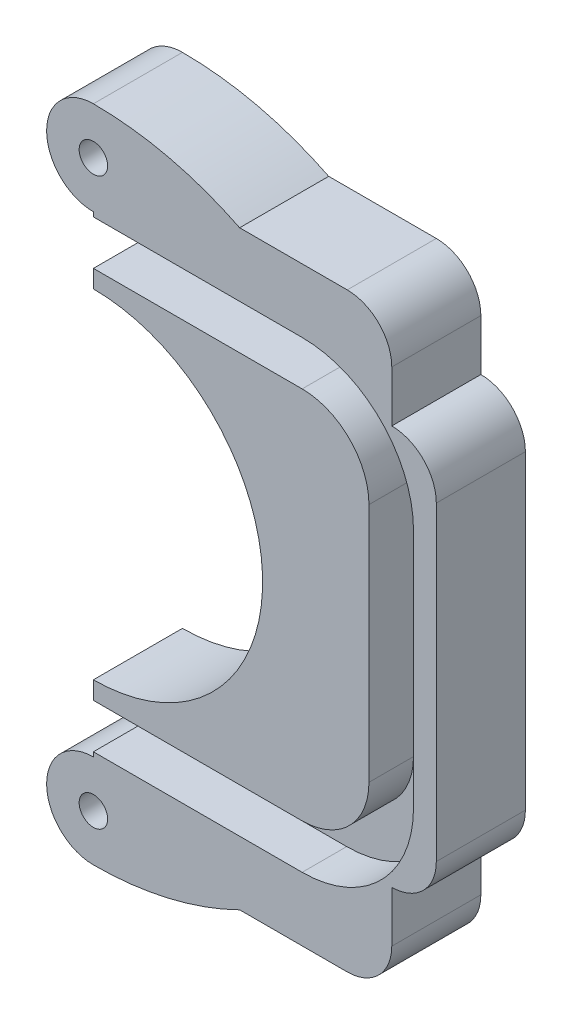
ISO-10303-21;
HEADER;
FILE_DESCRIPTION(('STEP AP214'),'2;1');
FILE_NAME('part.step','',(''),(''),'','','');
FILE_SCHEMA(('AUTOMOTIVE_DESIGN { 1 0 10303 214 1 1 1 1 }'));
ENDSEC;
DATA;
#1=APPLICATION_CONTEXT('core data for automotive mechanical design processes');
#2=APPLICATION_PROTOCOL_DEFINITION('international standard','automotive_design',2000,#1);
#3=PRODUCT_CONTEXT('',#1,'mechanical');
#4=PRODUCT('Part','Part','',(#3));
#5=PRODUCT_RELATED_PRODUCT_CATEGORY('part','',(#4));
#6=PRODUCT_DEFINITION_FORMATION('','',#4);
#7=PRODUCT_DEFINITION_CONTEXT('part definition',#1,'design');
#8=PRODUCT_DEFINITION('design','',#6,#7);
#9=PRODUCT_DEFINITION_SHAPE('','',#8);
#10=(LENGTH_UNIT() NAMED_UNIT(*) SI_UNIT(.MILLI.,.METRE.));
#11=(NAMED_UNIT(*) PLANE_ANGLE_UNIT() SI_UNIT($,.RADIAN.));
#12=(NAMED_UNIT(*) SI_UNIT($,.STERADIAN.) SOLID_ANGLE_UNIT());
#13=UNCERTAINTY_MEASURE_WITH_UNIT(LENGTH_MEASURE(1.E-05),#10,'distance_accuracy_value','');
#14=(GEOMETRIC_REPRESENTATION_CONTEXT(3) GLOBAL_UNCERTAINTY_ASSIGNED_CONTEXT((#13)) GLOBAL_UNIT_ASSIGNED_CONTEXT((#10,
#11,#12)) REPRESENTATION_CONTEXT('',''));
#15=CARTESIAN_POINT('',(0.,0.,0.));
#16=DIRECTION('',(0.,0.,1.));
#17=DIRECTION('',(1.,0.,0.));
#18=AXIS2_PLACEMENT_3D('',#15,#16,#17);
#19=CARTESIAN_POINT('',(0.,0.,10.));
#20=DIRECTION('',(0.,0.,1.));
#21=DIRECTION('',(1.,0.,0.));
#22=AXIS2_PLACEMENT_3D('',#19,#20,#21);
#23=PLANE('',#22);
#24=DIRECTION('',(1.,0.,0.));
#25=VECTOR('',#24,1.);
#26=CARTESIAN_POINT('',(0.,-151.667340501082,10.));
#27=LINE('',#26,#25);
#28=CARTESIAN_POINT('',(-48.1265911761758,-151.667340501082,10.));
#29=VERTEX_POINT('',#28);
#30=CARTESIAN_POINT('',(-24.6887468039078,-151.667340501082,10.));
#31=VERTEX_POINT('',#30);
#32=EDGE_CURVE('E51',#29,#31,#27,.T.);
#33=ORIENTED_EDGE('',*,*,#32,.F.);
#34=DIRECTION('',(0.,1.,0.));
#35=VECTOR('',#34,1.);
#36=CARTESIAN_POINT('',(-48.1265911761761,0.,10.));
#37=LINE('',#36,#35);
#38=CARTESIAN_POINT('',(-48.1265911761758,-153.667340501079,10.));
#39=VERTEX_POINT('',#38);
#40=EDGE_CURVE('E194',#39,#29,#37,.T.);
#41=ORIENTED_EDGE('',*,*,#40,.F.);
#42=CARTESIAN_POINT('',(-48.1265911761758,-172.667340501079,10.));
#43=DIRECTION('',(0.,0.,1.));
#44=DIRECTION('',(1.,0.,0.));
#45=AXIS2_PLACEMENT_3D('',#42,#43,#44);
#46=CIRCLE('',#45,19.);
#47=CARTESIAN_POINT('',(-48.1265911761758,-191.667340501079,10.));
#48=VERTEX_POINT('',#47);
#49=EDGE_CURVE('E249',#48,#39,#46,.T.);
#50=ORIENTED_EDGE('',*,*,#49,.F.);
#51=DIRECTION('',(0.,1.,0.));
#52=VECTOR('',#51,1.);
#53=CARTESIAN_POINT('',(-48.1265911761754,0.,10.));
#54=LINE('',#53,#52);
#55=CARTESIAN_POINT('',(-48.1265911761758,-193.667340501082,10.));
#56=VERTEX_POINT('',#55);
#57=EDGE_CURVE('E122',#56,#48,#54,.T.);
#58=ORIENTED_EDGE('',*,*,#57,.F.);
#59=DIRECTION('',(1.,0.,0.));
#60=VECTOR('',#59,1.);
#61=CARTESIAN_POINT('',(0.,-193.667340501082,10.));
#62=LINE('',#61,#60);
#63=CARTESIAN_POINT('',(-24.6887468039078,-193.667340501082,10.));
#64=VERTEX_POINT('',#63);
#65=EDGE_CURVE('E463',#56,#64,#62,.T.);
#66=ORIENTED_EDGE('',*,*,#65,.T.);
#67=CARTESIAN_POINT('',(-24.6887468039078,-186.167340501082,10.));
#68=DIRECTION('',(0.,0.,1.));
#69=DIRECTION('',(1.,0.,0.));
#70=AXIS2_PLACEMENT_3D('',#67,#68,#69);
#71=CIRCLE('',#70,7.5);
#72=CARTESIAN_POINT('',(-17.1887468039078,-186.167340501082,10.));
#73=VERTEX_POINT('',#72);
#74=EDGE_CURVE('E460',#64,#73,#71,.T.);
#75=ORIENTED_EDGE('',*,*,#74,.T.);
#76=DIRECTION('',(0.,1.,0.));
#77=VECTOR('',#76,1.);
#78=CARTESIAN_POINT('',(-17.1887468039078,0.,10.));
#79=LINE('',#78,#77);
#80=CARTESIAN_POINT('',(-17.1887468039078,-159.167340501082,10.));
#81=VERTEX_POINT('',#80);
#82=EDGE_CURVE('E457',#73,#81,#79,.T.);
#83=ORIENTED_EDGE('',*,*,#82,.T.);
#84=CARTESIAN_POINT('',(-24.6887468039078,-159.167340501082,10.));
#85=DIRECTION('',(0.,0.,1.));
#86=DIRECTION('',(1.,0.,0.));
#87=AXIS2_PLACEMENT_3D('',#84,#85,#86);
#88=CIRCLE('',#87,7.5);
#89=EDGE_CURVE('E455',#31,#81,#88,.F.);
#90=ORIENTED_EDGE('',*,*,#89,.F.);
#91=EDGE_LOOP('',(#33,#41,#50,#58,#66,#75,#83,#90));
#92=FACE_BOUND('',#91,.T.);
#93=ADVANCED_FACE('F36',(#92),#23,.T.);
#94=CARTESIAN_POINT('',(-48.1265911761758,-172.667340501079,10.));
#95=DIRECTION('',(0.,0.,-1.));
#96=DIRECTION('',(-1.,0.,0.));
#97=AXIS2_PLACEMENT_3D('',#94,#95,#96);
#98=CYLINDRICAL_SURFACE('',#97,19.);
#99=CARTESIAN_POINT('',(-48.1265911761758,-172.667340501079,0.));
#100=DIRECTION('',(0.,0.,1.));
#101=DIRECTION('',(1.,0.,0.));
#102=AXIS2_PLACEMENT_3D('',#99,#100,#101);
#103=CIRCLE('',#102,19.);
#104=CARTESIAN_POINT('',(-48.1265911761758,-191.667340501079,0.));
#105=VERTEX_POINT('',#104);
#106=CARTESIAN_POINT('',(-48.1265911761758,-153.667340501079,0.));
#107=VERTEX_POINT('',#106);
#108=EDGE_CURVE('E204',#105,#107,#103,.T.);
#109=ORIENTED_EDGE('',*,*,#108,.F.);
#110=DIRECTION('',(0.,0.,-1.));
#111=VECTOR('',#110,1.);
#112=CARTESIAN_POINT('',(-48.1265911761758,-191.667340501079,10.));
#113=LINE('',#112,#111);
#114=EDGE_CURVE('E11',#48,#105,#113,.T.);
#115=ORIENTED_EDGE('',*,*,#114,.F.);
#116=ORIENTED_EDGE('',*,*,#49,.T.);
#117=DIRECTION('',(0.,0.,-1.));
#118=VECTOR('',#117,1.);
#119=CARTESIAN_POINT('',(-48.1265911761758,-153.667340501079,10.));
#120=LINE('',#119,#118);
#121=EDGE_CURVE('E60',#39,#107,#120,.T.);
#122=ORIENTED_EDGE('',*,*,#121,.T.);
#123=EDGE_LOOP('',(#109,#115,#116,#122));
#124=FACE_BOUND('',#123,.T.);
#125=ADVANCED_FACE('F38',(#124),#98,.F.);
#126=CARTESIAN_POINT('',(-48.1265911761754,0.,10.));
#127=DIRECTION('',(-1.,0.,0.));
#128=DIRECTION('',(0.,-1.,0.));
#129=AXIS2_PLACEMENT_3D('',#126,#127,#128);
#130=PLANE('',#129);
#131=DIRECTION('',(0.,0.,1.));
#132=VECTOR('',#131,1.);
#133=CARTESIAN_POINT('',(-48.1265911761758,-198.667340501082,5.));
#134=LINE('',#133,#132);
#135=CARTESIAN_POINT('',(-48.1265911761758,-198.667340501082,5.));
#136=VERTEX_POINT('',#135);
#137=CARTESIAN_POINT('',(-48.1265911761758,-198.667340501082,10.));
#138=VERTEX_POINT('',#137);
#139=EDGE_CURVE('E486',#136,#138,#134,.T.);
#140=ORIENTED_EDGE('',*,*,#139,.F.);
#141=DIRECTION('',(0.,-1.,0.));
#142=VECTOR('',#141,1.);
#143=CARTESIAN_POINT('',(-48.1265911761754,0.,5.));
#144=LINE('',#143,#142);
#145=CARTESIAN_POINT('',(-48.1265911761758,-193.667340501082,5.));
#146=VERTEX_POINT('',#145);
#147=EDGE_CURVE('E437',#146,#136,#144,.T.);
#148=ORIENTED_EDGE('',*,*,#147,.F.);
#149=DIRECTION('',(0.,0.,1.));
#150=VECTOR('',#149,1.);
#151=CARTESIAN_POINT('',(-48.1265911761758,-193.667340501082,5.));
#152=LINE('',#151,#150);
#153=EDGE_CURVE('E488',#146,#56,#152,.T.);
#154=ORIENTED_EDGE('',*,*,#153,.T.);
#155=ORIENTED_EDGE('',*,*,#57,.T.);
#156=ORIENTED_EDGE('',*,*,#114,.T.);
#157=DIRECTION('',(0.,1.,0.));
#158=VECTOR('',#157,1.);
#159=CARTESIAN_POINT('',(-48.1265911761754,0.,0.));
#160=LINE('',#159,#158);
#161=CARTESIAN_POINT('',(-48.1265911761758,-199.167340501079,0.));
#162=VERTEX_POINT('',#161);
#163=EDGE_CURVE('E206',#162,#105,#160,.T.);
#164=ORIENTED_EDGE('',*,*,#163,.F.);
#165=DIRECTION('',(0.,0.,-1.));
#166=VECTOR('',#165,1.);
#167=CARTESIAN_POINT('',(-48.1265911761758,-199.167340501079,10.));
#168=LINE('',#167,#166);
#169=CARTESIAN_POINT('',(-48.1265911761758,-199.167340501079,10.));
#170=VERTEX_POINT('',#169);
#171=EDGE_CURVE('E44',#170,#162,#168,.T.);
#172=ORIENTED_EDGE('',*,*,#171,.F.);
#173=EDGE_CURVE('E303',#170,#138,#54,.T.);
#174=ORIENTED_EDGE('',*,*,#173,.T.);
#175=EDGE_LOOP('',(#140,#148,#154,#155,#156,#164,#172,#174));
#176=FACE_BOUND('',#175,.T.);
#177=ADVANCED_FACE('F287',(#176),#130,.T.);
#178=CARTESIAN_POINT('',(-48.1265911761758,-204.417342708545,10.));
#179=DIRECTION('',(0.,0.,-1.));
#180=DIRECTION('',(-1.,0.,0.));
#181=AXIS2_PLACEMENT_3D('',#178,#179,#180);
#182=CYLINDRICAL_SURFACE('',#181,5.25000220746617);
#183=CARTESIAN_POINT('',(-48.1265911761758,-204.417342708545,0.));
#184=DIRECTION('',(0.,0.,1.));
#185=DIRECTION('',(1.,0.,0.));
#186=AXIS2_PLACEMENT_3D('',#183,#184,#185);
#187=CIRCLE('',#186,5.25000220746617);
#188=CARTESIAN_POINT('',(-48.1265911761758,-209.667344916011,0.));
#189=VERTEX_POINT('',#188);
#190=EDGE_CURVE('E210',#189,#162,#187,.F.);
#191=ORIENTED_EDGE('',*,*,#190,.F.);
#192=DIRECTION('',(0.,0.,-1.));
#193=VECTOR('',#192,1.);
#194=CARTESIAN_POINT('',(-48.1265911761758,-209.667344916011,10.));
#195=LINE('',#194,#193);
#196=CARTESIAN_POINT('',(-48.1265911761758,-209.667344916011,10.));
#197=VERTEX_POINT('',#196);
#198=EDGE_CURVE('E276',#197,#189,#195,.T.);
#199=ORIENTED_EDGE('',*,*,#198,.F.);
#200=CARTESIAN_POINT('',(-48.1265911761758,-204.417342708545,10.));
#201=DIRECTION('',(0.,0.,1.));
#202=DIRECTION('',(1.,0.,0.));
#203=AXIS2_PLACEMENT_3D('',#200,#201,#202);
#204=CIRCLE('',#203,5.25000220746617);
#205=EDGE_CURVE('E283',#197,#170,#204,.F.);
#206=ORIENTED_EDGE('',*,*,#205,.T.);
#207=ORIENTED_EDGE('',*,*,#171,.T.);
#208=EDGE_LOOP('',(#191,#199,#206,#207));
#209=FACE_BOUND('',#208,.T.);
#210=ADVANCED_FACE('F281',(#209),#182,.T.);
#211=CARTESIAN_POINT('',(-48.1265911761758,-172.667340501079,10.));
#212=DIRECTION('',(0.,0.,-1.));
#213=DIRECTION('',(-1.,0.,0.));
#214=AXIS2_PLACEMENT_3D('',#211,#212,#213);
#215=CYLINDRICAL_SURFACE('',#214,37.0000044149324);
#216=CARTESIAN_POINT('',(-48.1265911761758,-172.667340501079,0.));
#217=DIRECTION('',(0.,0.,1.));
#218=DIRECTION('',(1.,0.,0.));
#219=AXIS2_PLACEMENT_3D('',#216,#217,#218);
#220=CIRCLE('',#219,37.0000044149324);
#221=CARTESIAN_POINT('',(-31.7060790227308,-205.824045815744,0.));
#222=VERTEX_POINT('',#221);
#223=EDGE_CURVE('E213',#189,#222,#220,.T.);
#224=ORIENTED_EDGE('',*,*,#223,.T.);
#225=DIRECTION('',(0.,0.,-1.));
#226=VECTOR('',#225,1.);
#227=CARTESIAN_POINT('',(-31.7060790227308,-205.824045815744,10.));
#228=LINE('',#227,#226);
#229=CARTESIAN_POINT('',(-31.7060790227308,-205.824045815744,10.));
#230=VERTEX_POINT('',#229);
#231=EDGE_CURVE('E274',#230,#222,#228,.T.);
#232=ORIENTED_EDGE('',*,*,#231,.F.);
#233=CARTESIAN_POINT('',(-48.1265911761758,-172.667340501079,10.));
#234=DIRECTION('',(0.,0.,1.));
#235=DIRECTION('',(1.,0.,0.));
#236=AXIS2_PLACEMENT_3D('',#233,#234,#235);
#237=CIRCLE('',#236,37.0000044149324);
#238=EDGE_CURVE('E298',#197,#230,#237,.T.);
#239=ORIENTED_EDGE('',*,*,#238,.F.);
#240=ORIENTED_EDGE('',*,*,#198,.T.);
#241=EDGE_LOOP('',(#224,#232,#239,#240));
#242=FACE_BOUND('',#241,.T.);
#243=ADVANCED_FACE('F295',(#242),#215,.T.);
#244=CARTESIAN_POINT('',(0.,-205.824045815744,10.));
#245=DIRECTION('',(0.,-1.,0.));
#246=DIRECTION('',(0.,0.,-1.));
#247=AXIS2_PLACEMENT_3D('',#244,#245,#246);
#248=PLANE('',#247);
#249=DIRECTION('',(-1.,0.,0.));
#250=VECTOR('',#249,1.);
#251=CARTESIAN_POINT('',(0.,-205.824045815744,0.));
#252=LINE('',#251,#250);
#253=CARTESIAN_POINT('',(-19.6282092260401,-205.824045815744,0.));
#254=VERTEX_POINT('',#253);
#255=EDGE_CURVE('E216',#254,#222,#252,.T.);
#256=ORIENTED_EDGE('',*,*,#255,.F.);
#257=DIRECTION('',(0.,0.,-1.));
#258=VECTOR('',#257,1.);
#259=CARTESIAN_POINT('',(-19.6282092260401,-205.824045815744,10.));
#260=LINE('',#259,#258);
#261=CARTESIAN_POINT('',(-19.6282092260401,-205.824045815744,10.));
#262=VERTEX_POINT('',#261);
#263=EDGE_CURVE('E272',#262,#254,#260,.T.);
#264=ORIENTED_EDGE('',*,*,#263,.F.);
#265=DIRECTION('',(-1.,0.,0.));
#266=VECTOR('',#265,1.);
#267=CARTESIAN_POINT('',(0.,-205.824045815744,10.));
#268=LINE('',#267,#266);
#269=EDGE_CURVE('E300',#262,#230,#268,.T.);
#270=ORIENTED_EDGE('',*,*,#269,.T.);
#271=ORIENTED_EDGE('',*,*,#231,.T.);
#272=EDGE_LOOP('',(#256,#264,#270,#271));
#273=FACE_BOUND('',#272,.T.);
#274=ADVANCED_FACE('F591',(#273),#248,.T.);
#275=CARTESIAN_POINT('',(-19.6282092260401,-200.824045815744,10.));
#276=DIRECTION('',(0.,0.,-1.));
#277=DIRECTION('',(-1.,0.,0.));
#278=AXIS2_PLACEMENT_3D('',#275,#276,#277);
#279=CYLINDRICAL_SURFACE('',#278,5.);
#280=CARTESIAN_POINT('',(-19.6282092260401,-200.824045815744,0.));
#281=DIRECTION('',(0.,0.,1.));
#282=DIRECTION('',(1.,0.,0.));
#283=AXIS2_PLACEMENT_3D('',#280,#281,#282);
#284=CIRCLE('',#283,5.);
#285=CARTESIAN_POINT('',(-14.6282092260401,-200.824045815744,0.));
#286=VERTEX_POINT('',#285);
#287=EDGE_CURVE('E219',#286,#254,#284,.F.);
#288=ORIENTED_EDGE('',*,*,#287,.F.);
#289=DIRECTION('',(0.,0.,-1.));
#290=VECTOR('',#289,1.);
#291=CARTESIAN_POINT('',(-14.6282092260401,-200.824045815744,10.));
#292=LINE('',#291,#290);
#293=CARTESIAN_POINT('',(-14.6282092260401,-200.824045815744,10.));
#294=VERTEX_POINT('',#293);
#295=EDGE_CURVE('E270',#294,#286,#292,.T.);
#296=ORIENTED_EDGE('',*,*,#295,.F.);
#297=CARTESIAN_POINT('',(-19.6282092260401,-200.824045815744,10.));
#298=DIRECTION('',(0.,0.,1.));
#299=DIRECTION('',(1.,0.,0.));
#300=AXIS2_PLACEMENT_3D('',#297,#298,#299);
#301=CIRCLE('',#300,5.);
#302=EDGE_CURVE('E309',#294,#262,#301,.F.);
#303=ORIENTED_EDGE('',*,*,#302,.T.);
#304=ORIENTED_EDGE('',*,*,#263,.T.);
#305=EDGE_LOOP('',(#288,#296,#303,#304));
#306=FACE_BOUND('',#305,.T.);
#307=ADVANCED_FACE('F587',(#306),#279,.T.);
#308=CARTESIAN_POINT('',(-14.6282092260401,0.,10.));
#309=DIRECTION('',(1.,0.,0.));
#310=DIRECTION('',(0.,0.,-1.));
#311=AXIS2_PLACEMENT_3D('',#308,#309,#310);
#312=PLANE('',#311);
#313=DIRECTION('',(0.,-1.,0.));
#314=VECTOR('',#313,1.);
#315=CARTESIAN_POINT('',(-14.6282092260401,0.,0.));
#316=LINE('',#315,#314);
#317=CARTESIAN_POINT('',(-14.6282092260401,-195.092578039896,0.));
#318=VERTEX_POINT('',#317);
#319=EDGE_CURVE('E222',#318,#286,#316,.T.);
#320=ORIENTED_EDGE('',*,*,#319,.F.);
#321=DIRECTION('',(0.,0.,-1.));
#322=VECTOR('',#321,1.);
#323=CARTESIAN_POINT('',(-14.6282092260401,-195.092578039896,10.));
#324=LINE('',#323,#322);
#325=CARTESIAN_POINT('',(-14.6282092260401,-195.092578039896,10.));
#326=VERTEX_POINT('',#325);
#327=EDGE_CURVE('E268',#326,#318,#324,.T.);
#328=ORIENTED_EDGE('',*,*,#327,.F.);
#329=DIRECTION('',(0.,-1.,0.));
#330=VECTOR('',#329,1.);
#331=CARTESIAN_POINT('',(-14.6282092260401,0.,10.));
#332=LINE('',#331,#330);
#333=EDGE_CURVE('E312',#326,#294,#332,.T.);
#334=ORIENTED_EDGE('',*,*,#333,.T.);
#335=ORIENTED_EDGE('',*,*,#295,.T.);
#336=EDGE_LOOP('',(#320,#328,#334,#335));
#337=FACE_BOUND('',#336,.T.);
#338=ADVANCED_FACE('F583',(#337),#312,.T.);
#339=CARTESIAN_POINT('',(-14.6282092260401,-190.092578039896,10.));
#340=DIRECTION('',(0.,0.,-1.));
#341=DIRECTION('',(-1.,0.,0.));
#342=AXIS2_PLACEMENT_3D('',#339,#340,#341);
#343=CYLINDRICAL_SURFACE('',#342,5.);
#344=CARTESIAN_POINT('',(-14.6282092260401,-190.092578039896,0.));
#345=DIRECTION('',(0.,0.,1.));
#346=DIRECTION('',(1.,0.,0.));
#347=AXIS2_PLACEMENT_3D('',#344,#345,#346);
#348=CIRCLE('',#347,5.);
#349=CARTESIAN_POINT('',(-9.62820922604008,-190.092578039896,0.));
#350=VERTEX_POINT('',#349);
#351=EDGE_CURVE('E225',#318,#350,#348,.T.);
#352=ORIENTED_EDGE('',*,*,#351,.T.);
#353=DIRECTION('',(0.,0.,-1.));
#354=VECTOR('',#353,1.);
#355=CARTESIAN_POINT('',(-9.62820922604008,-190.092578039896,10.));
#356=LINE('',#355,#354);
#357=CARTESIAN_POINT('',(-9.62820922604008,-190.092578039896,10.));
#358=VERTEX_POINT('',#357);
#359=EDGE_CURVE('E265',#358,#350,#356,.T.);
#360=ORIENTED_EDGE('',*,*,#359,.F.);
#361=CARTESIAN_POINT('',(-14.6282092260401,-190.092578039896,10.));
#362=DIRECTION('',(0.,0.,1.));
#363=DIRECTION('',(1.,0.,0.));
#364=AXIS2_PLACEMENT_3D('',#361,#362,#363);
#365=CIRCLE('',#364,5.);
#366=EDGE_CURVE('E315',#326,#358,#365,.T.);
#367=ORIENTED_EDGE('',*,*,#366,.F.);
#368=ORIENTED_EDGE('',*,*,#327,.T.);
#369=EDGE_LOOP('',(#352,#360,#367,#368));
#370=FACE_BOUND('',#369,.T.);
#371=ADVANCED_FACE('F579',(#370),#343,.T.);
#372=CARTESIAN_POINT('',(-9.62820922604008,0.,10.));
#373=DIRECTION('',(-1.,0.,0.));
#374=DIRECTION('',(0.,0.,1.));
#375=AXIS2_PLACEMENT_3D('',#372,#373,#374);
#376=PLANE('',#375);
#377=DIRECTION('',(0.,1.,0.));
#378=VECTOR('',#377,1.);
#379=CARTESIAN_POINT('',(-9.62820922604008,0.,0.));
#380=LINE('',#379,#378);
#381=CARTESIAN_POINT('',(-9.62820922604008,-155.239636863425,0.));
#382=VERTEX_POINT('',#381);
#383=EDGE_CURVE('E227',#350,#382,#380,.T.);
#384=ORIENTED_EDGE('',*,*,#383,.T.);
#385=DIRECTION('',(0.,0.,-1.));
#386=VECTOR('',#385,1.);
#387=CARTESIAN_POINT('',(-9.62820922604008,-155.239636863425,10.));
#388=LINE('',#387,#386);
#389=CARTESIAN_POINT('',(-9.62820922604008,-155.239636863425,10.));
#390=VERTEX_POINT('',#389);
#391=EDGE_CURVE('E262',#390,#382,#388,.T.);
#392=ORIENTED_EDGE('',*,*,#391,.F.);
#393=DIRECTION('',(0.,1.,0.));
#394=VECTOR('',#393,1.);
#395=CARTESIAN_POINT('',(-9.62820922604008,0.,10.));
#396=LINE('',#395,#394);
#397=EDGE_CURVE('E317',#358,#390,#396,.T.);
#398=ORIENTED_EDGE('',*,*,#397,.F.);
#399=ORIENTED_EDGE('',*,*,#359,.T.);
#400=EDGE_LOOP('',(#384,#392,#398,#399));
#401=FACE_BOUND('',#400,.T.);
#402=ADVANCED_FACE('F575',(#401),#376,.F.);
#403=CARTESIAN_POINT('',(-14.6282090740635,-155.240869651084,10.));
#404=DIRECTION('',(0.,0.,-1.));
#405=DIRECTION('',(-1.,0.,0.));
#406=AXIS2_PLACEMENT_3D('',#403,#404,#405);
#407=CYLINDRICAL_SURFACE('',#406,5.00000000000002);
#408=CARTESIAN_POINT('',(-14.6282090740635,-155.240869651084,0.));
#409=DIRECTION('',(0.,0.,1.));
#410=DIRECTION('',(1.,0.,0.));
#411=AXIS2_PLACEMENT_3D('',#408,#409,#410);
#412=CIRCLE('',#411,5.00000000000002);
#413=CARTESIAN_POINT('',(-14.6265911761759,-150.240869912843,0.));
#414=VERTEX_POINT('',#413);
#415=EDGE_CURVE('E229',#382,#414,#412,.T.);
#416=ORIENTED_EDGE('',*,*,#415,.T.);
#417=DIRECTION('',(0.,0.,-1.));
#418=VECTOR('',#417,1.);
#419=CARTESIAN_POINT('',(-14.6265911761759,-150.240869912843,10.));
#420=LINE('',#419,#418);
#421=CARTESIAN_POINT('',(-14.6265911761759,-150.240869912843,10.));
#422=VERTEX_POINT('',#421);
#423=EDGE_CURVE('E259',#422,#414,#420,.T.);
#424=ORIENTED_EDGE('',*,*,#423,.F.);
#425=CARTESIAN_POINT('',(-14.6282090740635,-155.240869651084,10.));
#426=DIRECTION('',(0.,0.,1.));
#427=DIRECTION('',(1.,0.,0.));
#428=AXIS2_PLACEMENT_3D('',#425,#426,#427);
#429=CIRCLE('',#428,5.00000000000002);
#430=EDGE_CURVE('E319',#390,#422,#429,.T.);
#431=ORIENTED_EDGE('',*,*,#430,.F.);
#432=ORIENTED_EDGE('',*,*,#391,.T.);
#433=EDGE_LOOP('',(#416,#424,#431,#432));
#434=FACE_BOUND('',#433,.T.);
#435=ADVANCED_FACE('F571',(#434),#407,.T.);
#436=CARTESIAN_POINT('',(-14.6265911761759,0.,10.));
#437=DIRECTION('',(-1.,0.,0.));
#438=DIRECTION('',(0.,0.,1.));
#439=AXIS2_PLACEMENT_3D('',#436,#437,#438);
#440=PLANE('',#439);
#441=DIRECTION('',(0.,1.,0.));
#442=VECTOR('',#441,1.);
#443=CARTESIAN_POINT('',(-14.6265911761759,0.,0.));
#444=LINE('',#443,#442);
#445=CARTESIAN_POINT('',(-14.6265911761759,-144.510294404022,0.));
#446=VERTEX_POINT('',#445);
#447=EDGE_CURVE('E231',#414,#446,#444,.T.);
#448=ORIENTED_EDGE('',*,*,#447,.T.);
#449=DIRECTION('',(0.,0.,-1.));
#450=VECTOR('',#449,1.);
#451=CARTESIAN_POINT('',(-14.6265911761759,-144.510294404022,10.));
#452=LINE('',#451,#450);
#453=CARTESIAN_POINT('',(-14.6265911761759,-144.510294404022,10.));
#454=VERTEX_POINT('',#453);
#455=EDGE_CURVE('E256',#454,#446,#452,.T.);
#456=ORIENTED_EDGE('',*,*,#455,.F.);
#457=DIRECTION('',(0.,1.,0.));
#458=VECTOR('',#457,1.);
#459=CARTESIAN_POINT('',(-14.6265911761759,0.,10.));
#460=LINE('',#459,#458);
#461=EDGE_CURVE('E321',#422,#454,#460,.T.);
#462=ORIENTED_EDGE('',*,*,#461,.F.);
#463=ORIENTED_EDGE('',*,*,#423,.T.);
#464=EDGE_LOOP('',(#448,#456,#462,#463));
#465=FACE_BOUND('',#464,.T.);
#466=ADVANCED_FACE('F568',(#465),#440,.F.);
#467=CARTESIAN_POINT('',(-19.6265911761759,-144.510294404022,10.));
#468=DIRECTION('',(0.,0.,-1.));
#469=DIRECTION('',(-1.,0.,0.));
#470=AXIS2_PLACEMENT_3D('',#467,#468,#469);
#471=CYLINDRICAL_SURFACE('',#470,5.);
#472=CARTESIAN_POINT('',(-19.6265911761759,-144.510294404022,0.));
#473=DIRECTION('',(0.,0.,1.));
#474=DIRECTION('',(1.,0.,0.));
#475=AXIS2_PLACEMENT_3D('',#472,#473,#474);
#476=CIRCLE('',#475,5.);
#477=CARTESIAN_POINT('',(-19.626591176176,-139.510294404022,0.));
#478=VERTEX_POINT('',#477);
#479=EDGE_CURVE('E233',#446,#478,#476,.T.);
#480=ORIENTED_EDGE('',*,*,#479,.T.);
#481=DIRECTION('',(0.,0.,-1.));
#482=VECTOR('',#481,1.);
#483=CARTESIAN_POINT('',(-19.626591176176,-139.510294404022,10.));
#484=LINE('',#483,#482);
#485=CARTESIAN_POINT('',(-19.626591176176,-139.510294404022,10.));
#486=VERTEX_POINT('',#485);
#487=EDGE_CURVE('E253',#486,#478,#484,.T.);
#488=ORIENTED_EDGE('',*,*,#487,.F.);
#489=CARTESIAN_POINT('',(-19.6265911761759,-144.510294404022,10.));
#490=DIRECTION('',(0.,0.,1.));
#491=DIRECTION('',(1.,0.,0.));
#492=AXIS2_PLACEMENT_3D('',#489,#490,#491);
#493=CIRCLE('',#492,5.);
#494=EDGE_CURVE('E323',#454,#486,#493,.T.);
#495=ORIENTED_EDGE('',*,*,#494,.F.);
#496=ORIENTED_EDGE('',*,*,#455,.T.);
#497=EDGE_LOOP('',(#480,#488,#495,#496));
#498=FACE_BOUND('',#497,.T.);
#499=ADVANCED_FACE('F329',(#498),#471,.T.);
#500=CARTESIAN_POINT('',(0.,-139.510294404022,10.));
#501=DIRECTION('',(0.,-1.,0.));
#502=DIRECTION('',(0.,0.,-1.));
#503=AXIS2_PLACEMENT_3D('',#500,#501,#502);
#504=PLANE('',#503);
#505=DIRECTION('',(-1.,0.,0.));
#506=VECTOR('',#505,1.);
#507=CARTESIAN_POINT('',(0.,-139.510294404022,0.));
#508=LINE('',#507,#506);
#509=CARTESIAN_POINT('',(-31.7067771054365,-139.510294404022,0.));
#510=VERTEX_POINT('',#509);
#511=EDGE_CURVE('E235',#478,#510,#508,.T.);
#512=ORIENTED_EDGE('',*,*,#511,.T.);
#513=DIRECTION('',(0.,0.,-1.));
#514=VECTOR('',#513,1.);
#515=CARTESIAN_POINT('',(-31.7067771054365,-139.510294404022,10.));
#516=LINE('',#515,#514);
#517=CARTESIAN_POINT('',(-31.7067771054365,-139.510294404022,10.));
#518=VERTEX_POINT('',#517);
#519=EDGE_CURVE('E187',#518,#510,#516,.T.);
#520=ORIENTED_EDGE('',*,*,#519,.F.);
#521=DIRECTION('',(-1.,0.,0.));
#522=VECTOR('',#521,1.);
#523=CARTESIAN_POINT('',(0.,-139.510294404022,10.));
#524=LINE('',#523,#522);
#525=EDGE_CURVE('E174',#486,#518,#524,.T.);
#526=ORIENTED_EDGE('',*,*,#525,.F.);
#527=ORIENTED_EDGE('',*,*,#487,.T.);
#528=EDGE_LOOP('',(#512,#520,#526,#527));
#529=FACE_BOUND('',#528,.T.);
#530=ADVANCED_FACE('F333',(#529),#504,.F.);
#531=CARTESIAN_POINT('',(-48.1265911761758,-172.667340501079,10.));
#532=DIRECTION('',(0.,0.,-1.));
#533=DIRECTION('',(-1.,0.,0.));
#534=AXIS2_PLACEMENT_3D('',#531,#532,#533);
#535=CYLINDRICAL_SURFACE('',#534,37.);
#536=CARTESIAN_POINT('',(-48.1265911761758,-172.667340501079,0.));
#537=DIRECTION('',(0.,0.,1.));
#538=DIRECTION('',(1.,0.,0.));
#539=AXIS2_PLACEMENT_3D('',#536,#537,#538);
#540=CIRCLE('',#539,37.);
#541=CARTESIAN_POINT('',(-48.1265911761758,-135.667340501079,0.));
#542=VERTEX_POINT('',#541);
#543=EDGE_CURVE('E183',#510,#542,#540,.T.);
#544=ORIENTED_EDGE('',*,*,#543,.T.);
#545=DIRECTION('',(0.,0.,-1.));
#546=VECTOR('',#545,1.);
#547=CARTESIAN_POINT('',(-48.1265911761758,-135.667340501079,10.));
#548=LINE('',#547,#546);
#549=CARTESIAN_POINT('',(-48.1265911761758,-135.667340501079,10.));
#550=VERTEX_POINT('',#549);
#551=EDGE_CURVE('E180',#550,#542,#548,.T.);
#552=ORIENTED_EDGE('',*,*,#551,.F.);
#553=CARTESIAN_POINT('',(-48.1265911761758,-172.667340501079,10.));
#554=DIRECTION('',(0.,0.,1.));
#555=DIRECTION('',(1.,0.,0.));
#556=AXIS2_PLACEMENT_3D('',#553,#554,#555);
#557=CIRCLE('',#556,37.);
#558=EDGE_CURVE('E166',#518,#550,#557,.T.);
#559=ORIENTED_EDGE('',*,*,#558,.F.);
#560=ORIENTED_EDGE('',*,*,#519,.T.);
#561=EDGE_LOOP('',(#544,#552,#559,#560));
#562=FACE_BOUND('',#561,.T.);
#563=ADVANCED_FACE('F181',(#562),#535,.T.);
#564=CARTESIAN_POINT('',(-48.1265911761758,-140.917340501079,10.));
#565=DIRECTION('',(0.,0.,-1.));
#566=DIRECTION('',(-1.,0.,0.));
#567=AXIS2_PLACEMENT_3D('',#564,#565,#566);
#568=CYLINDRICAL_SURFACE('',#567,5.25);
#569=CARTESIAN_POINT('',(-48.1265911761758,-140.917340501079,0.));
#570=DIRECTION('',(0.,0.,1.));
#571=DIRECTION('',(1.,0.,0.));
#572=AXIS2_PLACEMENT_3D('',#569,#570,#571);
#573=CIRCLE('',#572,5.25);
#574=CARTESIAN_POINT('',(-48.1265911761758,-146.167340501079,0.));
#575=VERTEX_POINT('',#574);
#576=EDGE_CURVE('E238',#575,#542,#573,.F.);
#577=ORIENTED_EDGE('',*,*,#576,.F.);
#578=DIRECTION('',(0.,0.,-1.));
#579=VECTOR('',#578,1.);
#580=CARTESIAN_POINT('',(-48.1265911761758,-146.167340501079,10.));
#581=LINE('',#580,#579);
#582=CARTESIAN_POINT('',(-48.1265911761758,-146.167340501079,10.));
#583=VERTEX_POINT('',#582);
#584=EDGE_CURVE('E188',#583,#575,#581,.T.);
#585=ORIENTED_EDGE('',*,*,#584,.F.);
#586=CARTESIAN_POINT('',(-48.1265911761758,-140.917340501079,10.));
#587=DIRECTION('',(0.,0.,1.));
#588=DIRECTION('',(1.,0.,0.));
#589=AXIS2_PLACEMENT_3D('',#586,#587,#588);
#590=CIRCLE('',#589,5.25);
#591=EDGE_CURVE('E172',#583,#550,#590,.F.);
#592=ORIENTED_EDGE('',*,*,#591,.T.);
#593=ORIENTED_EDGE('',*,*,#551,.T.);
#594=EDGE_LOOP('',(#577,#585,#592,#593));
#595=FACE_BOUND('',#594,.T.);
#596=ADVANCED_FACE('F191',(#595),#568,.T.);
#597=CARTESIAN_POINT('',(-48.1265911761758,-140.917340501079,10.));
#598=DIRECTION('',(0.,0.,-1.));
#599=DIRECTION('',(-1.,0.,0.));
#600=AXIS2_PLACEMENT_3D('',#597,#598,#599);
#601=CYLINDRICAL_SURFACE('',#600,1.6);
#602=CARTESIAN_POINT('',(-48.1265911761758,-140.917340501079,10.));
#603=DIRECTION('',(0.,0.,1.));
#604=DIRECTION('',(1.,0.,0.));
#605=AXIS2_PLACEMENT_3D('',#602,#603,#604);
#606=CIRCLE('',#605,1.6);
#607=CARTESIAN_POINT('',(-46.5265911761758,-140.917340501079,10.));
#608=VERTEX_POINT('',#607);
#609=EDGE_CURVE('E198',#608,#608,#606,.T.);
#610=ORIENTED_EDGE('',*,*,#609,.T.);
#611=EDGE_LOOP('',(#610));
#612=FACE_BOUND('',#611,.T.);
#613=CARTESIAN_POINT('',(-48.1265911761758,-140.917340501079,0.));
#614=DIRECTION('',(0.,0.,1.));
#615=DIRECTION('',(1.,0.,0.));
#616=AXIS2_PLACEMENT_3D('',#613,#614,#615);
#617=CIRCLE('',#616,1.6);
#618=CARTESIAN_POINT('',(-46.5265911761758,-140.917340501079,0.));
#619=VERTEX_POINT('',#618);
#620=EDGE_CURVE('E243',#619,#619,#617,.T.);
#621=ORIENTED_EDGE('',*,*,#620,.F.);
#622=EDGE_LOOP('',(#621));
#623=FACE_BOUND('',#622,.T.);
#624=ADVANCED_FACE('F553',(#612,#623),#601,.F.);
#625=CARTESIAN_POINT('',(-48.1265911761761,0.,10.));
#626=DIRECTION('',(-1.,0.,0.));
#627=DIRECTION('',(0.,-1.,0.));
#628=AXIS2_PLACEMENT_3D('',#625,#626,#627);
#629=PLANE('',#628);
#630=DIRECTION('',(0.,0.,1.));
#631=VECTOR('',#630,1.);
#632=CARTESIAN_POINT('',(-48.1265911761758,-151.667340501082,5.));
#633=LINE('',#632,#631);
#634=CARTESIAN_POINT('',(-48.1265911761758,-151.667340501082,5.));
#635=VERTEX_POINT('',#634);
#636=EDGE_CURVE('E207',#635,#29,#633,.T.);
#637=ORIENTED_EDGE('',*,*,#636,.F.);
#638=DIRECTION('',(0.,-1.,0.));
#639=VECTOR('',#638,1.);
#640=CARTESIAN_POINT('',(-48.1265911761761,0.,5.));
#641=LINE('',#640,#639);
#642=CARTESIAN_POINT('',(-48.1265911761758,-146.667340501082,5.));
#643=VERTEX_POINT('',#642);
#644=EDGE_CURVE('E416',#643,#635,#641,.T.);
#645=ORIENTED_EDGE('',*,*,#644,.F.);
#646=DIRECTION('',(0.,0.,1.));
#647=VECTOR('',#646,1.);
#648=CARTESIAN_POINT('',(-48.1265911761758,-146.667340501082,5.));
#649=LINE('',#648,#647);
#650=CARTESIAN_POINT('',(-48.1265911761758,-146.667340501082,10.));
#651=VERTEX_POINT('',#650);
#652=EDGE_CURVE('E340',#643,#651,#649,.T.);
#653=ORIENTED_EDGE('',*,*,#652,.T.);
#654=EDGE_CURVE('E192',#651,#583,#37,.T.);
#655=ORIENTED_EDGE('',*,*,#654,.T.);
#656=ORIENTED_EDGE('',*,*,#584,.T.);
#657=DIRECTION('',(0.,1.,0.));
#658=VECTOR('',#657,1.);
#659=CARTESIAN_POINT('',(-48.1265911761761,0.,0.));
#660=LINE('',#659,#658);
#661=EDGE_CURVE('E240',#107,#575,#660,.T.);
#662=ORIENTED_EDGE('',*,*,#661,.F.);
#663=ORIENTED_EDGE('',*,*,#121,.F.);
#664=ORIENTED_EDGE('',*,*,#40,.T.);
#665=EDGE_LOOP('',(#637,#645,#653,#655,#656,#662,#663,#664));
#666=FACE_BOUND('',#665,.T.);
#667=ADVANCED_FACE('F335',(#666),#629,.T.);
#668=CARTESIAN_POINT('',(-48.1265911761758,-204.417342708545,10.));
#669=DIRECTION('',(0.,0.,-1.));
#670=DIRECTION('',(-1.,0.,0.));
#671=AXIS2_PLACEMENT_3D('',#668,#669,#670);
#672=CYLINDRICAL_SURFACE('',#671,1.6);
#673=CARTESIAN_POINT('',(-48.1265911761758,-204.417342708545,10.));
#674=DIRECTION('',(0.,0.,1.));
#675=DIRECTION('',(1.,0.,0.));
#676=AXIS2_PLACEMENT_3D('',#673,#674,#675);
#677=CIRCLE('',#676,1.6);
#678=CARTESIAN_POINT('',(-46.5265911761758,-204.417342708545,10.));
#679=VERTEX_POINT('',#678);
#680=EDGE_CURVE('E201',#679,#679,#677,.T.);
#681=ORIENTED_EDGE('',*,*,#680,.T.);
#682=EDGE_LOOP('',(#681));
#683=FACE_BOUND('',#682,.T.);
#684=CARTESIAN_POINT('',(-48.1265911761758,-204.417342708545,0.));
#685=DIRECTION('',(0.,0.,1.));
#686=DIRECTION('',(1.,0.,0.));
#687=AXIS2_PLACEMENT_3D('',#684,#685,#686);
#688=CIRCLE('',#687,1.6);
#689=CARTESIAN_POINT('',(-46.5265911761758,-204.417342708545,0.));
#690=VERTEX_POINT('',#689);
#691=EDGE_CURVE('E246',#690,#690,#688,.T.);
#692=ORIENTED_EDGE('',*,*,#691,.F.);
#693=EDGE_LOOP('',(#692));
#694=FACE_BOUND('',#693,.T.);
#695=ADVANCED_FACE('F543',(#683,#694),#672,.F.);
#696=ORIENTED_EDGE('',*,*,#654,.F.);
#697=DIRECTION('',(1.,0.,0.));
#698=VECTOR('',#697,1.);
#699=CARTESIAN_POINT('',(0.,-146.667340501082,10.));
#700=LINE('',#699,#698);
#701=CARTESIAN_POINT('',(-24.6887468039078,-146.667340501082,10.));
#702=VERTEX_POINT('',#701);
#703=EDGE_CURVE('E345',#651,#702,#700,.T.);
#704=ORIENTED_EDGE('',*,*,#703,.T.);
#705=CARTESIAN_POINT('',(-24.6887468039078,-159.167340501082,10.));
#706=DIRECTION('',(0.,0.,1.));
#707=DIRECTION('',(1.,0.,0.));
#708=AXIS2_PLACEMENT_3D('',#705,#706,#707);
#709=CIRCLE('',#708,12.5);
#710=CARTESIAN_POINT('',(-12.1887468039077,-159.167340501082,10.));
#711=VERTEX_POINT('',#710);
#712=EDGE_CURVE('E429',#702,#711,#709,.F.);
#713=ORIENTED_EDGE('',*,*,#712,.T.);
#714=DIRECTION('',(0.,1.,0.));
#715=VECTOR('',#714,1.);
#716=CARTESIAN_POINT('',(-12.1887468039077,0.,10.));
#717=LINE('',#716,#715);
#718=CARTESIAN_POINT('',(-12.1887468039077,-186.167340501082,10.));
#719=VERTEX_POINT('',#718);
#720=EDGE_CURVE('E472',#719,#711,#717,.T.);
#721=ORIENTED_EDGE('',*,*,#720,.F.);
#722=CARTESIAN_POINT('',(-24.6887468039078,-186.167340501082,10.));
#723=DIRECTION('',(0.,0.,1.));
#724=DIRECTION('',(1.,0.,0.));
#725=AXIS2_PLACEMENT_3D('',#722,#723,#724);
#726=CIRCLE('',#725,12.5);
#727=CARTESIAN_POINT('',(-24.6887468039078,-198.667340501082,10.));
#728=VERTEX_POINT('',#727);
#729=EDGE_CURVE('E469',#728,#719,#726,.T.);
#730=ORIENTED_EDGE('',*,*,#729,.F.);
#731=DIRECTION('',(1.,0.,0.));
#732=VECTOR('',#731,1.);
#733=CARTESIAN_POINT('',(0.,-198.667340501082,10.));
#734=LINE('',#733,#732);
#735=EDGE_CURVE('E466',#138,#728,#734,.T.);
#736=ORIENTED_EDGE('',*,*,#735,.F.);
#737=ORIENTED_EDGE('',*,*,#173,.F.);
#738=ORIENTED_EDGE('',*,*,#205,.F.);
#739=ORIENTED_EDGE('',*,*,#238,.T.);
#740=ORIENTED_EDGE('',*,*,#269,.F.);
#741=ORIENTED_EDGE('',*,*,#302,.F.);
#742=ORIENTED_EDGE('',*,*,#333,.F.);
#743=ORIENTED_EDGE('',*,*,#366,.T.);
#744=ORIENTED_EDGE('',*,*,#397,.T.);
#745=ORIENTED_EDGE('',*,*,#430,.T.);
#746=ORIENTED_EDGE('',*,*,#461,.T.);
#747=ORIENTED_EDGE('',*,*,#494,.T.);
#748=ORIENTED_EDGE('',*,*,#525,.T.);
#749=ORIENTED_EDGE('',*,*,#558,.T.);
#750=ORIENTED_EDGE('',*,*,#591,.F.);
#751=EDGE_LOOP('',(#696,#704,#713,#721,#730,#736,#737,#738,#739,#740,#741,#742,#743,#744,#745,
#746,#747,#748,#749,#750));
#752=FACE_BOUND('',#751,.T.);
#753=ORIENTED_EDGE('',*,*,#609,.F.);
#754=EDGE_LOOP('',(#753));
#755=FACE_BOUND('',#754,.T.);
#756=ORIENTED_EDGE('',*,*,#680,.F.);
#757=EDGE_LOOP('',(#756));
#758=FACE_BOUND('',#757,.T.);
#759=ADVANCED_FACE('F169',(#752,#755,#758),#23,.T.);
#760=CARTESIAN_POINT('',(0.,0.,0.));
#761=DIRECTION('',(0.,0.,1.));
#762=DIRECTION('',(1.,0.,0.));
#763=AXIS2_PLACEMENT_3D('',#760,#761,#762);
#764=PLANE('',#763);
#765=ORIENTED_EDGE('',*,*,#108,.T.);
#766=ORIENTED_EDGE('',*,*,#661,.T.);
#767=ORIENTED_EDGE('',*,*,#576,.T.);
#768=ORIENTED_EDGE('',*,*,#543,.F.);
#769=ORIENTED_EDGE('',*,*,#511,.F.);
#770=ORIENTED_EDGE('',*,*,#479,.F.);
#771=ORIENTED_EDGE('',*,*,#447,.F.);
#772=ORIENTED_EDGE('',*,*,#415,.F.);
#773=ORIENTED_EDGE('',*,*,#383,.F.);
#774=ORIENTED_EDGE('',*,*,#351,.F.);
#775=ORIENTED_EDGE('',*,*,#319,.T.);
#776=ORIENTED_EDGE('',*,*,#287,.T.);
#777=ORIENTED_EDGE('',*,*,#255,.T.);
#778=ORIENTED_EDGE('',*,*,#223,.F.);
#779=ORIENTED_EDGE('',*,*,#190,.T.);
#780=ORIENTED_EDGE('',*,*,#163,.T.);
#781=EDGE_LOOP('',(#765,#766,#767,#768,#769,#770,#771,#772,#773,#774,#775,#776,#777,#778,#779,#780));
#782=FACE_BOUND('',#781,.T.);
#783=ORIENTED_EDGE('',*,*,#620,.T.);
#784=EDGE_LOOP('',(#783));
#785=FACE_BOUND('',#784,.T.);
#786=ORIENTED_EDGE('',*,*,#691,.T.);
#787=EDGE_LOOP('',(#786));
#788=FACE_BOUND('',#787,.T.);
#789=ADVANCED_FACE('F290',(#782,#785,#788),#764,.F.);
#790=CARTESIAN_POINT('',(0.,-151.667340501082,5.));
#791=DIRECTION('',(0.,-1.,0.));
#792=DIRECTION('',(0.,0.,-1.));
#793=AXIS2_PLACEMENT_3D('',#790,#791,#792);
#794=PLANE('',#793);
#795=ORIENTED_EDGE('',*,*,#32,.T.);
#796=DIRECTION('',(0.,0.,1.));
#797=VECTOR('',#796,1.);
#798=CARTESIAN_POINT('',(-24.6887468039078,-151.667340501082,5.));
#799=LINE('',#798,#797);
#800=CARTESIAN_POINT('',(-24.6887468039078,-151.667340501082,5.));
#801=VERTEX_POINT('',#800);
#802=EDGE_CURVE('E406',#801,#31,#799,.T.);
#803=ORIENTED_EDGE('',*,*,#802,.F.);
#804=DIRECTION('',(1.,0.,0.));
#805=VECTOR('',#804,1.);
#806=CARTESIAN_POINT('',(0.,-151.667340501082,5.));
#807=LINE('',#806,#805);
#808=EDGE_CURVE('E410',#635,#801,#807,.T.);
#809=ORIENTED_EDGE('',*,*,#808,.F.);
#810=ORIENTED_EDGE('',*,*,#636,.T.);
#811=EDGE_LOOP('',(#795,#803,#809,#810));
#812=FACE_BOUND('',#811,.T.);
#813=ADVANCED_FACE('F408',(#812),#794,.F.);
#814=CARTESIAN_POINT('',(0.,-146.667340501082,5.));
#815=DIRECTION('',(0.,-1.,0.));
#816=DIRECTION('',(0.,0.,-1.));
#817=AXIS2_PLACEMENT_3D('',#814,#815,#816);
#818=PLANE('',#817);
#819=ORIENTED_EDGE('',*,*,#703,.F.);
#820=ORIENTED_EDGE('',*,*,#652,.F.);
#821=DIRECTION('',(1.,0.,0.));
#822=VECTOR('',#821,1.);
#823=CARTESIAN_POINT('',(0.,-146.667340501082,5.));
#824=LINE('',#823,#822);
#825=CARTESIAN_POINT('',(-24.6887468039078,-146.667340501082,5.));
#826=VERTEX_POINT('',#825);
#827=EDGE_CURVE('E451',#643,#826,#824,.T.);
#828=ORIENTED_EDGE('',*,*,#827,.T.);
#829=DIRECTION('',(0.,0.,1.));
#830=VECTOR('',#829,1.);
#831=CARTESIAN_POINT('',(-24.6887468039078,-146.667340501082,5.));
#832=LINE('',#831,#830);
#833=EDGE_CURVE('E478',#826,#702,#832,.T.);
#834=ORIENTED_EDGE('',*,*,#833,.T.);
#835=EDGE_LOOP('',(#819,#820,#828,#834));
#836=FACE_BOUND('',#835,.T.);
#837=ADVANCED_FACE('F526',(#836),#818,.T.);
#838=CARTESIAN_POINT('',(-24.6887468039078,-159.167340501082,5.));
#839=DIRECTION('',(0.,0.,1.));
#840=DIRECTION('',(1.,0.,0.));
#841=AXIS2_PLACEMENT_3D('',#838,#839,#840);
#842=CYLINDRICAL_SURFACE('',#841,12.5);
#843=ORIENTED_EDGE('',*,*,#712,.F.);
#844=ORIENTED_EDGE('',*,*,#833,.F.);
#845=CARTESIAN_POINT('',(-24.6887468039078,-159.167340501082,5.));
#846=DIRECTION('',(0.,0.,1.));
#847=DIRECTION('',(1.,0.,0.));
#848=AXIS2_PLACEMENT_3D('',#845,#846,#847);
#849=CIRCLE('',#848,12.5);
#850=CARTESIAN_POINT('',(-12.1887468039077,-159.167340501082,5.));
#851=VERTEX_POINT('',#850);
#852=EDGE_CURVE('E449',#826,#851,#849,.F.);
#853=ORIENTED_EDGE('',*,*,#852,.T.);
#854=DIRECTION('',(0.,0.,1.));
#855=VECTOR('',#854,1.);
#856=CARTESIAN_POINT('',(-12.1887468039077,-159.167340501082,5.));
#857=LINE('',#856,#855);
#858=EDGE_CURVE('E480',#851,#711,#857,.T.);
#859=ORIENTED_EDGE('',*,*,#858,.T.);
#860=EDGE_LOOP('',(#843,#844,#853,#859));
#861=FACE_BOUND('',#860,.T.);
#862=ADVANCED_FACE('F525',(#861),#842,.F.);
#863=CARTESIAN_POINT('',(-12.1887468039077,0.,5.));
#864=DIRECTION('',(1.,0.,0.));
#865=DIRECTION('',(0.,0.,-1.));
#866=AXIS2_PLACEMENT_3D('',#863,#864,#865);
#867=PLANE('',#866);
#868=ORIENTED_EDGE('',*,*,#720,.T.);
#869=ORIENTED_EDGE('',*,*,#858,.F.);
#870=DIRECTION('',(0.,1.,0.));
#871=VECTOR('',#870,1.);
#872=CARTESIAN_POINT('',(-12.1887468039077,0.,5.));
#873=LINE('',#872,#871);
#874=CARTESIAN_POINT('',(-12.1887468039077,-186.167340501082,5.));
#875=VERTEX_POINT('',#874);
#876=EDGE_CURVE('E446',#875,#851,#873,.T.);
#877=ORIENTED_EDGE('',*,*,#876,.F.);
#878=DIRECTION('',(0.,0.,1.));
#879=VECTOR('',#878,1.);
#880=CARTESIAN_POINT('',(-12.1887468039077,-186.167340501082,5.));
#881=LINE('',#880,#879);
#882=EDGE_CURVE('E482',#875,#719,#881,.T.);
#883=ORIENTED_EDGE('',*,*,#882,.T.);
#884=EDGE_LOOP('',(#868,#869,#877,#883));
#885=FACE_BOUND('',#884,.T.);
#886=ADVANCED_FACE('F520',(#885),#867,.F.);
#887=CARTESIAN_POINT('',(-24.6887468039078,-186.167340501082,5.));
#888=DIRECTION('',(0.,0.,1.));
#889=DIRECTION('',(1.,0.,0.));
#890=AXIS2_PLACEMENT_3D('',#887,#888,#889);
#891=CYLINDRICAL_SURFACE('',#890,12.5);
#892=ORIENTED_EDGE('',*,*,#729,.T.);
#893=ORIENTED_EDGE('',*,*,#882,.F.);
#894=CARTESIAN_POINT('',(-24.6887468039078,-186.167340501082,5.));
#895=DIRECTION('',(0.,0.,1.));
#896=DIRECTION('',(1.,0.,0.));
#897=AXIS2_PLACEMENT_3D('',#894,#895,#896);
#898=CIRCLE('',#897,12.5);
#899=CARTESIAN_POINT('',(-24.6887468039078,-198.667340501082,5.));
#900=VERTEX_POINT('',#899);
#901=EDGE_CURVE('E443',#900,#875,#898,.T.);
#902=ORIENTED_EDGE('',*,*,#901,.F.);
#903=DIRECTION('',(0.,0.,1.));
#904=VECTOR('',#903,1.);
#905=CARTESIAN_POINT('',(-24.6887468039078,-198.667340501082,5.));
#906=LINE('',#905,#904);
#907=EDGE_CURVE('E484',#900,#728,#906,.T.);
#908=ORIENTED_EDGE('',*,*,#907,.T.);
#909=EDGE_LOOP('',(#892,#893,#902,#908));
#910=FACE_BOUND('',#909,.T.);
#911=ADVANCED_FACE('F515',(#910),#891,.F.);
#912=CARTESIAN_POINT('',(0.,-198.667340501082,5.));
#913=DIRECTION('',(0.,-1.,0.));
#914=DIRECTION('',(0.,0.,-1.));
#915=AXIS2_PLACEMENT_3D('',#912,#913,#914);
#916=PLANE('',#915);
#917=ORIENTED_EDGE('',*,*,#735,.T.);
#918=ORIENTED_EDGE('',*,*,#907,.F.);
#919=DIRECTION('',(1.,0.,0.));
#920=VECTOR('',#919,1.);
#921=CARTESIAN_POINT('',(0.,-198.667340501082,5.));
#922=LINE('',#921,#920);
#923=EDGE_CURVE('E440',#136,#900,#922,.T.);
#924=ORIENTED_EDGE('',*,*,#923,.F.);
#925=ORIENTED_EDGE('',*,*,#139,.T.);
#926=EDGE_LOOP('',(#917,#918,#924,#925));
#927=FACE_BOUND('',#926,.T.);
#928=ADVANCED_FACE('F512',(#927),#916,.F.);
#929=CARTESIAN_POINT('',(0.,-193.667340501082,5.));
#930=DIRECTION('',(0.,-1.,0.));
#931=DIRECTION('',(0.,0.,-1.));
#932=AXIS2_PLACEMENT_3D('',#929,#930,#931);
#933=PLANE('',#932);
#934=ORIENTED_EDGE('',*,*,#65,.F.);
#935=ORIENTED_EDGE('',*,*,#153,.F.);
#936=DIRECTION('',(1.,0.,0.));
#937=VECTOR('',#936,1.);
#938=CARTESIAN_POINT('',(0.,-193.667340501082,5.));
#939=LINE('',#938,#937);
#940=CARTESIAN_POINT('',(-24.6887468039078,-193.667340501082,5.));
#941=VERTEX_POINT('',#940);
#942=EDGE_CURVE('E435',#146,#941,#939,.T.);
#943=ORIENTED_EDGE('',*,*,#942,.T.);
#944=DIRECTION('',(0.,0.,1.));
#945=VECTOR('',#944,1.);
#946=CARTESIAN_POINT('',(-24.6887468039078,-193.667340501082,5.));
#947=LINE('',#946,#945);
#948=EDGE_CURVE('E490',#941,#64,#947,.T.);
#949=ORIENTED_EDGE('',*,*,#948,.T.);
#950=EDGE_LOOP('',(#934,#935,#943,#949));
#951=FACE_BOUND('',#950,.T.);
#952=ADVANCED_FACE('F509',(#951),#933,.T.);
#953=CARTESIAN_POINT('',(-24.6887468039078,-186.167340501082,5.));
#954=DIRECTION('',(0.,0.,1.));
#955=DIRECTION('',(1.,0.,0.));
#956=AXIS2_PLACEMENT_3D('',#953,#954,#955);
#957=CYLINDRICAL_SURFACE('',#956,7.5);
#958=ORIENTED_EDGE('',*,*,#74,.F.);
#959=ORIENTED_EDGE('',*,*,#948,.F.);
#960=CARTESIAN_POINT('',(-24.6887468039078,-186.167340501082,5.));
#961=DIRECTION('',(0.,0.,1.));
#962=DIRECTION('',(1.,0.,0.));
#963=AXIS2_PLACEMENT_3D('',#960,#961,#962);
#964=CIRCLE('',#963,7.5);
#965=CARTESIAN_POINT('',(-17.1887468039078,-186.167340501082,5.));
#966=VERTEX_POINT('',#965);
#967=EDGE_CURVE('E433',#941,#966,#964,.T.);
#968=ORIENTED_EDGE('',*,*,#967,.T.);
#969=DIRECTION('',(0.,0.,1.));
#970=VECTOR('',#969,1.);
#971=CARTESIAN_POINT('',(-17.1887468039078,-186.167340501082,5.));
#972=LINE('',#971,#970);
#973=EDGE_CURVE('E492',#966,#73,#972,.T.);
#974=ORIENTED_EDGE('',*,*,#973,.T.);
#975=EDGE_LOOP('',(#958,#959,#968,#974));
#976=FACE_BOUND('',#975,.T.);
#977=ADVANCED_FACE('F507',(#976),#957,.T.);
#978=CARTESIAN_POINT('',(-17.1887468039078,0.,5.));
#979=DIRECTION('',(1.,0.,0.));
#980=DIRECTION('',(0.,0.,-1.));
#981=AXIS2_PLACEMENT_3D('',#978,#979,#980);
#982=PLANE('',#981);
#983=ORIENTED_EDGE('',*,*,#82,.F.);
#984=ORIENTED_EDGE('',*,*,#973,.F.);
#985=DIRECTION('',(0.,1.,0.));
#986=VECTOR('',#985,1.);
#987=CARTESIAN_POINT('',(-17.1887468039078,0.,5.));
#988=LINE('',#987,#986);
#989=CARTESIAN_POINT('',(-17.1887468039078,-159.167340501082,5.));
#990=VERTEX_POINT('',#989);
#991=EDGE_CURVE('E424',#966,#990,#988,.T.);
#992=ORIENTED_EDGE('',*,*,#991,.T.);
#993=DIRECTION('',(0.,0.,1.));
#994=VECTOR('',#993,1.);
#995=CARTESIAN_POINT('',(-17.1887468039078,-159.167340501082,5.));
#996=LINE('',#995,#994);
#997=EDGE_CURVE('E415',#990,#81,#996,.T.);
#998=ORIENTED_EDGE('',*,*,#997,.T.);
#999=EDGE_LOOP('',(#983,#984,#992,#998));
#1000=FACE_BOUND('',#999,.T.);
#1001=ADVANCED_FACE('F501',(#1000),#982,.T.);
#1002=CARTESIAN_POINT('',(-24.6887468039078,-159.167340501082,5.));
#1003=DIRECTION('',(0.,0.,1.));
#1004=DIRECTION('',(1.,0.,0.));
#1005=AXIS2_PLACEMENT_3D('',#1002,#1003,#1004);
#1006=CYLINDRICAL_SURFACE('',#1005,7.5);
#1007=ORIENTED_EDGE('',*,*,#89,.T.);
#1008=ORIENTED_EDGE('',*,*,#997,.F.);
#1009=CARTESIAN_POINT('',(-24.6887468039078,-159.167340501082,5.));
#1010=DIRECTION('',(0.,0.,1.));
#1011=DIRECTION('',(1.,0.,0.));
#1012=AXIS2_PLACEMENT_3D('',#1009,#1010,#1011);
#1013=CIRCLE('',#1012,7.5);
#1014=EDGE_CURVE('E420',#801,#990,#1013,.F.);
#1015=ORIENTED_EDGE('',*,*,#1014,.F.);
#1016=ORIENTED_EDGE('',*,*,#802,.T.);
#1017=EDGE_LOOP('',(#1007,#1008,#1015,#1016));
#1018=FACE_BOUND('',#1017,.T.);
#1019=ADVANCED_FACE('F421',(#1018),#1006,.T.);
#1020=CARTESIAN_POINT('',(0.,0.,5.));
#1021=DIRECTION('',(0.,0.,1.));
#1022=DIRECTION('',(1.,0.,0.));
#1023=AXIS2_PLACEMENT_3D('',#1020,#1021,#1022);
#1024=PLANE('',#1023);
#1025=ORIENTED_EDGE('',*,*,#808,.T.);
#1026=ORIENTED_EDGE('',*,*,#1014,.T.);
#1027=ORIENTED_EDGE('',*,*,#991,.F.);
#1028=ORIENTED_EDGE('',*,*,#967,.F.);
#1029=ORIENTED_EDGE('',*,*,#942,.F.);
#1030=ORIENTED_EDGE('',*,*,#147,.T.);
#1031=ORIENTED_EDGE('',*,*,#923,.T.);
#1032=ORIENTED_EDGE('',*,*,#901,.T.);
#1033=ORIENTED_EDGE('',*,*,#876,.T.);
#1034=ORIENTED_EDGE('',*,*,#852,.F.);
#1035=ORIENTED_EDGE('',*,*,#827,.F.);
#1036=ORIENTED_EDGE('',*,*,#644,.T.);
#1037=EDGE_LOOP('',(#1025,#1026,#1027,#1028,#1029,#1030,#1031,#1032,#1033,#1034,#1035,#1036));
#1038=FACE_BOUND('',#1037,.T.);
#1039=ADVANCED_FACE('F426',(#1038),#1024,.T.);
#1040=CLOSED_SHELL('',(#93,#125,#177,#210,#243,#274,#307,#338,#371,#402,#435,#466,#499,#530,
#563,#596,#624,#667,#695,#759,#789,#813,#837,#862,#886,#911,#928,#952,#977,#1001,#1019,#1039));
#1041=MANIFOLD_SOLID_BREP('B2',#1040);
#1042=ADVANCED_BREP_SHAPE_REPRESENTATION('',(#18,#1041),#14);
#1043=SHAPE_DEFINITION_REPRESENTATION(#9,#1042);
ENDSEC;
END-ISO-10303-21;
